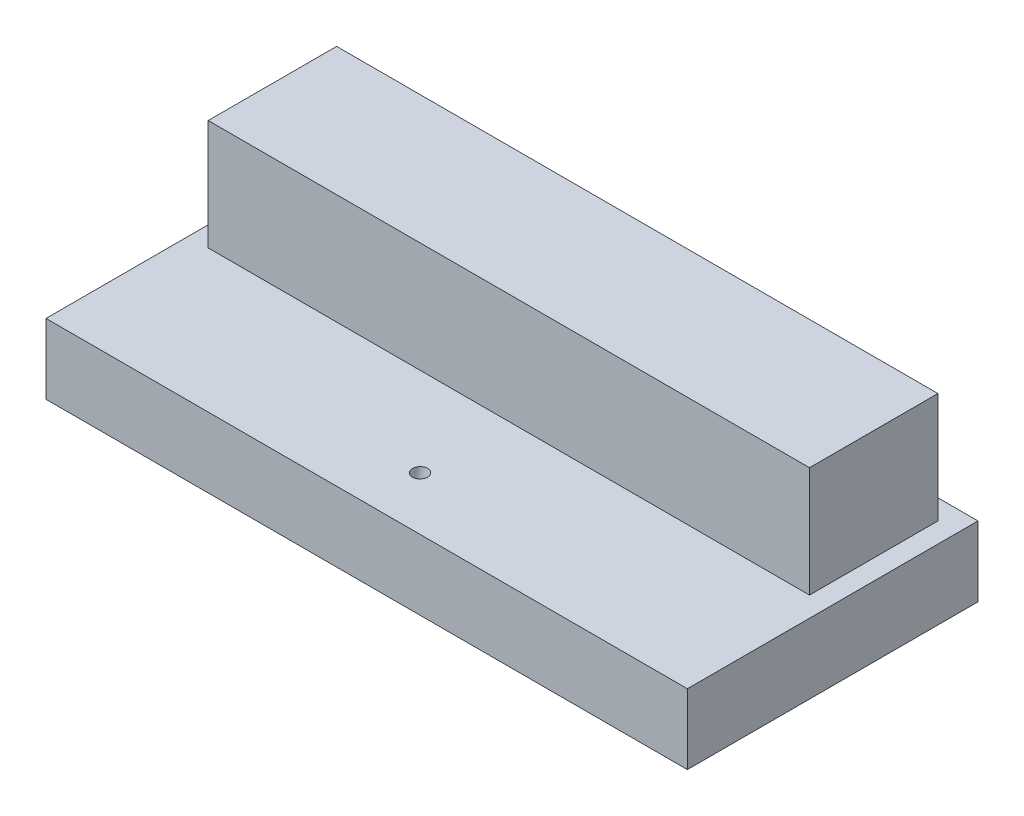
ISO-10303-21;
HEADER;
FILE_DESCRIPTION(('STEP AP214'),'2;1');
FILE_NAME('part.step','',(''),(''),'','','');
FILE_SCHEMA(('AUTOMOTIVE_DESIGN { 1 0 10303 214 1 1 1 1 }'));
ENDSEC;
DATA;
#1=APPLICATION_CONTEXT('core data for automotive mechanical design processes');
#2=APPLICATION_PROTOCOL_DEFINITION('international standard','automotive_design',2000,#1);
#3=PRODUCT_CONTEXT('',#1,'mechanical');
#4=PRODUCT('Part','Part','',(#3));
#5=PRODUCT_RELATED_PRODUCT_CATEGORY('part','',(#4));
#6=PRODUCT_DEFINITION_FORMATION('','',#4);
#7=PRODUCT_DEFINITION_CONTEXT('part definition',#1,'design');
#8=PRODUCT_DEFINITION('design','',#6,#7);
#9=PRODUCT_DEFINITION_SHAPE('','',#8);
#10=(LENGTH_UNIT() NAMED_UNIT(*) SI_UNIT(.MILLI.,.METRE.));
#11=(NAMED_UNIT(*) PLANE_ANGLE_UNIT() SI_UNIT($,.RADIAN.));
#12=(NAMED_UNIT(*) SI_UNIT($,.STERADIAN.) SOLID_ANGLE_UNIT());
#13=UNCERTAINTY_MEASURE_WITH_UNIT(LENGTH_MEASURE(1.E-05),#10,'distance_accuracy_value','');
#14=(GEOMETRIC_REPRESENTATION_CONTEXT(3) GLOBAL_UNCERTAINTY_ASSIGNED_CONTEXT((#13)) GLOBAL_UNIT_ASSIGNED_CONTEXT((#10,
#11,#12)) REPRESENTATION_CONTEXT('',''));
#15=CARTESIAN_POINT('',(0.,0.,0.));
#16=DIRECTION('',(0.,0.,1.));
#17=DIRECTION('',(1.,0.,0.));
#18=AXIS2_PLACEMENT_3D('',#15,#16,#17);
#19=CARTESIAN_POINT('',(39.035601562191,-7.74031022522725,-16.9085655572816));
#20=DIRECTION('',(0.,0.,-1.));
#21=DIRECTION('',(-1.,0.,0.));
#22=AXIS2_PLACEMENT_3D('',#19,#20,#21);
#23=PLANE('',#22);
#24=DIRECTION('',(-1.,0.,0.));
#25=VECTOR('',#24,1.);
#26=CARTESIAN_POINT('',(39.035601562191,14.2788182573859,-16.9085655572816));
#27=LINE('',#26,#25);
#28=CARTESIAN_POINT('',(39.035601562191,14.2788182573859,-16.9085655572816));
#29=VERTEX_POINT('',#28);
#30=CARTESIAN_POINT('',(-80.964398437809,14.2788182573859,-16.9085655572816));
#31=VERTEX_POINT('',#30);
#32=EDGE_CURVE('E133',#29,#31,#27,.T.);
#33=ORIENTED_EDGE('',*,*,#32,.T.);
#34=DIRECTION('',(0.,1.,0.));
#35=VECTOR('',#34,1.);
#36=CARTESIAN_POINT('',(-80.964398437809,-7.74031022522725,-16.9085655572816));
#37=LINE('',#36,#35);
#38=CARTESIAN_POINT('',(-80.964398437809,-7.74031022522725,-16.9085655572816));
#39=VERTEX_POINT('',#38);
#40=EDGE_CURVE('E11',#39,#31,#37,.T.);
#41=ORIENTED_EDGE('',*,*,#40,.F.);
#42=DIRECTION('',(-1.,0.,0.));
#43=VECTOR('',#42,1.);
#44=CARTESIAN_POINT('',(39.035601562191,-7.74031022522725,-16.9085655572816));
#45=LINE('',#44,#43);
#46=CARTESIAN_POINT('',(39.035601562191,-7.74031022522725,-16.9085655572816));
#47=VERTEX_POINT('',#46);
#48=EDGE_CURVE('E142',#47,#39,#45,.T.);
#49=ORIENTED_EDGE('',*,*,#48,.F.);
#50=DIRECTION('',(0.,1.,0.));
#51=VECTOR('',#50,1.);
#52=CARTESIAN_POINT('',(39.035601562191,-7.74031022522725,-16.9085655572816));
#53=LINE('',#52,#51);
#54=EDGE_CURVE('E151',#47,#29,#53,.T.);
#55=ORIENTED_EDGE('',*,*,#54,.T.);
#56=EDGE_LOOP('',(#33,#41,#49,#55));
#57=FACE_BOUND('',#56,.T.);
#58=ADVANCED_FACE('F33',(#57),#23,.F.);
#59=CARTESIAN_POINT('',(-80.964398437809,-7.74031022522725,-16.9085655572816));
#60=DIRECTION('',(1.,0.,0.));
#61=DIRECTION('',(0.,0.,-1.));
#62=AXIS2_PLACEMENT_3D('',#59,#60,#61);
#63=PLANE('',#62);
#64=DIRECTION('',(0.,0.,-1.));
#65=VECTOR('',#64,1.);
#66=CARTESIAN_POINT('',(-80.964398437809,14.2788182573859,-16.9085655572816));
#67=LINE('',#66,#65);
#68=CARTESIAN_POINT('',(-80.964398437809,14.2788182573859,-42.5395294604823));
#69=VERTEX_POINT('',#68);
#70=EDGE_CURVE('E136',#31,#69,#67,.T.);
#71=ORIENTED_EDGE('',*,*,#70,.T.);
#72=DIRECTION('',(0.,1.,0.));
#73=VECTOR('',#72,1.);
#74=CARTESIAN_POINT('',(-80.964398437809,-7.74031022522725,-42.5395294604823));
#75=LINE('',#74,#73);
#76=CARTESIAN_POINT('',(-80.964398437809,-7.74031022522725,-42.5395294604823));
#77=VERTEX_POINT('',#76);
#78=EDGE_CURVE('E42',#77,#69,#75,.T.);
#79=ORIENTED_EDGE('',*,*,#78,.F.);
#80=DIRECTION('',(0.,0.,-1.));
#81=VECTOR('',#80,1.);
#82=CARTESIAN_POINT('',(-80.964398437809,-7.74031022522725,-16.9085655572816));
#83=LINE('',#82,#81);
#84=EDGE_CURVE('E77',#39,#77,#83,.T.);
#85=ORIENTED_EDGE('',*,*,#84,.F.);
#86=ORIENTED_EDGE('',*,*,#40,.T.);
#87=EDGE_LOOP('',(#71,#79,#85,#86));
#88=FACE_BOUND('',#87,.T.);
#89=ADVANCED_FACE('F201',(#88),#63,.F.);
#90=CARTESIAN_POINT('',(-80.964398437809,-7.74031022522725,-42.5395294604823));
#91=DIRECTION('',(0.,0.,1.));
#92=DIRECTION('',(1.,0.,0.));
#93=AXIS2_PLACEMENT_3D('',#90,#91,#92);
#94=PLANE('',#93);
#95=DIRECTION('',(1.,0.,0.));
#96=VECTOR('',#95,1.);
#97=CARTESIAN_POINT('',(-80.964398437809,14.2788182573859,-42.5395294604823));
#98=LINE('',#97,#96);
#99=CARTESIAN_POINT('',(39.035601562191,14.2788182573859,-42.5395294604823));
#100=VERTEX_POINT('',#99);
#101=EDGE_CURVE('E67',#69,#100,#98,.T.);
#102=ORIENTED_EDGE('',*,*,#101,.T.);
#103=DIRECTION('',(0.,1.,0.));
#104=VECTOR('',#103,1.);
#105=CARTESIAN_POINT('',(39.035601562191,-7.74031022522725,-42.5395294604823));
#106=LINE('',#105,#104);
#107=CARTESIAN_POINT('',(39.035601562191,-7.74031022522725,-42.5395294604823));
#108=VERTEX_POINT('',#107);
#109=EDGE_CURVE('E51',#108,#100,#106,.T.);
#110=ORIENTED_EDGE('',*,*,#109,.F.);
#111=DIRECTION('',(1.,0.,0.));
#112=VECTOR('',#111,1.);
#113=CARTESIAN_POINT('',(-80.964398437809,-7.74031022522725,-42.5395294604823));
#114=LINE('',#113,#112);
#115=EDGE_CURVE('E146',#77,#108,#114,.T.);
#116=ORIENTED_EDGE('',*,*,#115,.F.);
#117=ORIENTED_EDGE('',*,*,#78,.T.);
#118=EDGE_LOOP('',(#102,#110,#116,#117));
#119=FACE_BOUND('',#118,.T.);
#120=ADVANCED_FACE('F206',(#119),#94,.F.);
#121=CARTESIAN_POINT('',(39.035601562191,-7.74031022522725,-42.5395294604823));
#122=DIRECTION('',(-1.,0.,0.));
#123=DIRECTION('',(0.,0.,1.));
#124=AXIS2_PLACEMENT_3D('',#121,#122,#123);
#125=PLANE('',#124);
#126=DIRECTION('',(0.,0.,1.));
#127=VECTOR('',#126,1.);
#128=CARTESIAN_POINT('',(39.035601562191,14.2788182573859,-42.5395294604823));
#129=LINE('',#128,#127);
#130=EDGE_CURVE('E72',#100,#29,#129,.T.);
#131=ORIENTED_EDGE('',*,*,#130,.T.);
#132=ORIENTED_EDGE('',*,*,#54,.F.);
#133=DIRECTION('',(0.,0.,1.));
#134=VECTOR('',#133,1.);
#135=CARTESIAN_POINT('',(39.035601562191,-7.74031022522725,-42.5395294604823));
#136=LINE('',#135,#134);
#137=EDGE_CURVE('E149',#108,#47,#136,.T.);
#138=ORIENTED_EDGE('',*,*,#137,.F.);
#139=ORIENTED_EDGE('',*,*,#109,.T.);
#140=EDGE_LOOP('',(#131,#132,#138,#139));
#141=FACE_BOUND('',#140,.T.);
#142=ADVANCED_FACE('F210',(#141),#125,.F.);
#143=CARTESIAN_POINT('',(0.,14.2788182573859,0.));
#144=DIRECTION('',(0.,-1.,0.));
#145=DIRECTION('',(0.,0.,-1.));
#146=AXIS2_PLACEMENT_3D('',#143,#144,#145);
#147=PLANE('',#146);
#148=ORIENTED_EDGE('',*,*,#32,.F.);
#149=ORIENTED_EDGE('',*,*,#130,.F.);
#150=ORIENTED_EDGE('',*,*,#101,.F.);
#151=ORIENTED_EDGE('',*,*,#70,.F.);
#152=EDGE_LOOP('',(#148,#149,#150,#151));
#153=FACE_BOUND('',#152,.T.);
#154=ADVANCED_FACE('F209',(#153),#147,.F.);
#155=CARTESIAN_POINT('',(0.,-7.74031022522725,0.));
#156=DIRECTION('',(0.,-1.,0.));
#157=DIRECTION('',(0.,0.,-1.));
#158=AXIS2_PLACEMENT_3D('',#155,#156,#157);
#159=PLANE('',#158);
#160=CARTESIAN_POINT('',(-20.964398437809,-7.74031022522725,0.815964066677682));
#161=DIRECTION('',(0.,-1.,0.));
#162=DIRECTION('',(0.,0.,1.));
#163=AXIS2_PLACEMENT_3D('',#160,#161,#162);
#164=ELLIPSE('',#163,1.52174637005962,1.5);
#165=CARTESIAN_POINT('',(-20.964398437809,-7.74031022522725,2.3377104367373));
#166=VERTEX_POINT('',#165);
#167=EDGE_CURVE('E36',#166,#166,#164,.F.);
#168=ORIENTED_EDGE('',*,*,#167,.F.);
#169=EDGE_LOOP('',(#168));
#170=FACE_BOUND('',#169,.T.);
#171=DIRECTION('',(1.,0.,0.));
#172=VECTOR('',#171,1.);
#173=CARTESIAN_POINT('',(-84.964398437809,-7.74031022522725,-46.5395294604823));
#174=LINE('',#173,#172);
#175=CARTESIAN_POINT('',(-84.964398437809,-7.74031022522725,-46.5395294604823));
#176=VERTEX_POINT('',#175);
#177=CARTESIAN_POINT('',(43.035601562191,-7.74031022522725,-46.5395294604823));
#178=VERTEX_POINT('',#177);
#179=EDGE_CURVE('E132',#176,#178,#174,.T.);
#180=ORIENTED_EDGE('',*,*,#179,.F.);
#181=DIRECTION('',(0.,0.,-1.));
#182=VECTOR('',#181,1.);
#183=CARTESIAN_POINT('',(-84.964398437809,-7.74031022522725,11.4604705395177));
#184=LINE('',#183,#182);
#185=CARTESIAN_POINT('',(-84.964398437809,-7.74031022522725,11.4604705395177));
#186=VERTEX_POINT('',#185);
#187=EDGE_CURVE('E128',#186,#176,#184,.T.);
#188=ORIENTED_EDGE('',*,*,#187,.F.);
#189=DIRECTION('',(-1.,0.,0.));
#190=VECTOR('',#189,1.);
#191=CARTESIAN_POINT('',(43.035601562191,-7.74031022522725,11.4604705395177));
#192=LINE('',#191,#190);
#193=CARTESIAN_POINT('',(43.035601562191,-7.74031022522725,11.4604705395177));
#194=VERTEX_POINT('',#193);
#195=EDGE_CURVE('E178',#194,#186,#192,.T.);
#196=ORIENTED_EDGE('',*,*,#195,.F.);
#197=DIRECTION('',(0.,0.,1.));
#198=VECTOR('',#197,1.);
#199=CARTESIAN_POINT('',(43.035601562191,-7.74031022522725,-46.5395294604823));
#200=LINE('',#199,#198);
#201=EDGE_CURVE('E176',#178,#194,#200,.T.);
#202=ORIENTED_EDGE('',*,*,#201,.F.);
#203=EDGE_LOOP('',(#180,#188,#196,#202));
#204=FACE_BOUND('',#203,.T.);
#205=ORIENTED_EDGE('',*,*,#137,.T.);
#206=ORIENTED_EDGE('',*,*,#48,.T.);
#207=ORIENTED_EDGE('',*,*,#84,.T.);
#208=ORIENTED_EDGE('',*,*,#115,.T.);
#209=EDGE_LOOP('',(#205,#206,#207,#208));
#210=FACE_BOUND('',#209,.T.);
#211=ADVANCED_FACE('F189',(#170,#204,#210),#159,.F.);
#212=CARTESIAN_POINT('',(-84.964398437809,-21.7211817426141,-46.5395294604823));
#213=DIRECTION('',(0.,0.,1.));
#214=DIRECTION('',(1.,0.,0.));
#215=AXIS2_PLACEMENT_3D('',#212,#213,#214);
#216=PLANE('',#215);
#217=ORIENTED_EDGE('',*,*,#179,.T.);
#218=DIRECTION('',(0.,1.,0.));
#219=VECTOR('',#218,1.);
#220=CARTESIAN_POINT('',(43.035601562191,-21.7211817426141,-46.5395294604823));
#221=LINE('',#220,#219);
#222=CARTESIAN_POINT('',(43.035601562191,-21.7211817426141,-46.5395294604823));
#223=VERTEX_POINT('',#222);
#224=EDGE_CURVE('E112',#223,#178,#221,.T.);
#225=ORIENTED_EDGE('',*,*,#224,.F.);
#226=DIRECTION('',(1.,0.,0.));
#227=VECTOR('',#226,1.);
#228=CARTESIAN_POINT('',(-84.964398437809,-21.7211817426141,-46.5395294604823));
#229=LINE('',#228,#227);
#230=CARTESIAN_POINT('',(-84.964398437809,-21.7211817426141,-46.5395294604823));
#231=VERTEX_POINT('',#230);
#232=EDGE_CURVE('E119',#231,#223,#229,.T.);
#233=ORIENTED_EDGE('',*,*,#232,.F.);
#234=DIRECTION('',(0.,1.,0.));
#235=VECTOR('',#234,1.);
#236=CARTESIAN_POINT('',(-84.964398437809,-21.7211817426141,-46.5395294604823));
#237=LINE('',#236,#235);
#238=EDGE_CURVE('E174',#231,#176,#237,.T.);
#239=ORIENTED_EDGE('',*,*,#238,.T.);
#240=EDGE_LOOP('',(#217,#225,#233,#239));
#241=FACE_BOUND('',#240,.T.);
#242=ADVANCED_FACE('F130',(#241),#216,.F.);
#243=CARTESIAN_POINT('',(43.035601562191,-21.7211817426141,-46.5395294604823));
#244=DIRECTION('',(-1.,0.,0.));
#245=DIRECTION('',(0.,0.,1.));
#246=AXIS2_PLACEMENT_3D('',#243,#244,#245);
#247=PLANE('',#246);
#248=ORIENTED_EDGE('',*,*,#201,.T.);
#249=DIRECTION('',(0.,1.,0.));
#250=VECTOR('',#249,1.);
#251=CARTESIAN_POINT('',(43.035601562191,-21.7211817426141,11.4604705395177));
#252=LINE('',#251,#250);
#253=CARTESIAN_POINT('',(43.035601562191,-21.7211817426141,11.4604705395177));
#254=VERTEX_POINT('',#253);
#255=EDGE_CURVE('E115',#254,#194,#252,.T.);
#256=ORIENTED_EDGE('',*,*,#255,.F.);
#257=DIRECTION('',(0.,0.,1.));
#258=VECTOR('',#257,1.);
#259=CARTESIAN_POINT('',(43.035601562191,-21.7211817426141,-46.5395294604823));
#260=LINE('',#259,#258);
#261=EDGE_CURVE('E108',#223,#254,#260,.T.);
#262=ORIENTED_EDGE('',*,*,#261,.F.);
#263=ORIENTED_EDGE('',*,*,#224,.T.);
#264=EDGE_LOOP('',(#248,#256,#262,#263));
#265=FACE_BOUND('',#264,.T.);
#266=ADVANCED_FACE('F110',(#265),#247,.F.);
#267=CARTESIAN_POINT('',(43.035601562191,-21.7211817426141,11.4604705395177));
#268=DIRECTION('',(0.,0.,-1.));
#269=DIRECTION('',(-1.,0.,0.));
#270=AXIS2_PLACEMENT_3D('',#267,#268,#269);
#271=PLANE('',#270);
#272=ORIENTED_EDGE('',*,*,#195,.T.);
#273=DIRECTION('',(0.,1.,0.));
#274=VECTOR('',#273,1.);
#275=CARTESIAN_POINT('',(-84.964398437809,-21.7211817426141,11.4604705395177));
#276=LINE('',#275,#274);
#277=CARTESIAN_POINT('',(-84.964398437809,-21.7211817426141,11.4604705395177));
#278=VERTEX_POINT('',#277);
#279=EDGE_CURVE('E138',#278,#186,#276,.T.);
#280=ORIENTED_EDGE('',*,*,#279,.F.);
#281=DIRECTION('',(-1.,0.,0.));
#282=VECTOR('',#281,1.);
#283=CARTESIAN_POINT('',(43.035601562191,-21.7211817426141,11.4604705395177));
#284=LINE('',#283,#282);
#285=EDGE_CURVE('E118',#254,#278,#284,.T.);
#286=ORIENTED_EDGE('',*,*,#285,.F.);
#287=ORIENTED_EDGE('',*,*,#255,.T.);
#288=EDGE_LOOP('',(#272,#280,#286,#287));
#289=FACE_BOUND('',#288,.T.);
#290=ADVANCED_FACE('F191',(#289),#271,.F.);
#291=CARTESIAN_POINT('',(-84.964398437809,-21.7211817426141,11.4604705395177));
#292=DIRECTION('',(1.,0.,0.));
#293=DIRECTION('',(0.,0.,-1.));
#294=AXIS2_PLACEMENT_3D('',#291,#292,#293);
#295=PLANE('',#294);
#296=ORIENTED_EDGE('',*,*,#187,.T.);
#297=ORIENTED_EDGE('',*,*,#238,.F.);
#298=DIRECTION('',(0.,0.,-1.));
#299=VECTOR('',#298,1.);
#300=CARTESIAN_POINT('',(-84.964398437809,-21.7211817426141,11.4604705395177));
#301=LINE('',#300,#299);
#302=EDGE_CURVE('E124',#278,#231,#301,.T.);
#303=ORIENTED_EDGE('',*,*,#302,.F.);
#304=ORIENTED_EDGE('',*,*,#279,.T.);
#305=EDGE_LOOP('',(#296,#297,#303,#304));
#306=FACE_BOUND('',#305,.T.);
#307=ADVANCED_FACE('F185',(#306),#295,.F.);
#308=CARTESIAN_POINT('',(0.,-21.7211817426141,0.));
#309=DIRECTION('',(0.,-1.,0.));
#310=DIRECTION('',(0.,0.,-1.));
#311=AXIS2_PLACEMENT_3D('',#308,#309,#310);
#312=PLANE('',#311);
#313=CARTESIAN_POINT('',(-20.964398437809,-21.7211817426141,3.20523487603564));
#314=DIRECTION('',(0.,-1.,0.));
#315=DIRECTION('',(0.,0.,1.));
#316=AXIS2_PLACEMENT_3D('',#313,#314,#315);
#317=ELLIPSE('',#316,3.55074153013912,3.5);
#318=CARTESIAN_POINT('',(-20.964398437809,-21.7211817426141,6.75597640617476));
#319=VERTEX_POINT('',#318);
#320=EDGE_CURVE('E158',#319,#319,#317,.T.);
#321=ORIENTED_EDGE('',*,*,#320,.F.);
#322=EDGE_LOOP('',(#321));
#323=FACE_BOUND('',#322,.T.);
#324=ORIENTED_EDGE('',*,*,#232,.T.);
#325=ORIENTED_EDGE('',*,*,#261,.T.);
#326=ORIENTED_EDGE('',*,*,#285,.T.);
#327=ORIENTED_EDGE('',*,*,#302,.T.);
#328=EDGE_LOOP('',(#324,#325,#326,#327));
#329=FACE_BOUND('',#328,.T.);
#330=ADVANCED_FACE('F122',(#323,#329),#312,.T.);
#331=CARTESIAN_POINT('',(-20.964398437809,27.8176326291864,-5.26073542928823));
#332=DIRECTION('',(0.,-0.985709596232669,0.168453530372113));
#333=DIRECTION('',(0.,-0.168453530372113,-0.985709596232669));
#334=AXIS2_PLACEMENT_3D('',#331,#332,#333);
#335=CYLINDRICAL_SURFACE('',#334,1.5);
#336=CARTESIAN_POINT('',(-20.964398437809,-13.4506291144963,1.79183300426778));
#337=DIRECTION('',(0.,0.985709596232669,-0.168453530372113));
#338=DIRECTION('',(0.,0.168453530372113,0.985709596232669));
#339=AXIS2_PLACEMENT_3D('',#336,#337,#338);
#340=CIRCLE('',#339,1.5);
#341=CARTESIAN_POINT('',(-20.964398437809,-13.1979488189382,3.27039739861678));
#342=VERTEX_POINT('',#341);
#343=EDGE_CURVE('E160',#342,#342,#340,.T.);
#344=ORIENTED_EDGE('',*,*,#343,.F.);
#345=EDGE_LOOP('',(#344));
#346=FACE_BOUND('',#345,.T.);
#347=ORIENTED_EDGE('',*,*,#167,.T.);
#348=EDGE_LOOP('',(#347));
#349=FACE_BOUND('',#348,.T.);
#350=ADVANCED_FACE('F232',(#346,#349),#335,.F.);
#351=CARTESIAN_POINT('',(-20.964398437809,-13.4506291144963,1.79183300426778));
#352=DIRECTION('',(0.,-0.985709596232669,0.168453530372113));
#353=DIRECTION('',(0.,-0.168453530372113,-0.985709596232669));
#354=AXIS2_PLACEMENT_3D('',#351,#352,#353);
#355=CYLINDRICAL_SURFACE('',#354,3.5);
#356=ORIENTED_EDGE('',*,*,#320,.T.);
#357=EDGE_LOOP('',(#356));
#358=FACE_BOUND('',#357,.T.);
#359=CARTESIAN_POINT('',(-20.964398437809,-13.4506291144963,1.79183300426778));
#360=DIRECTION('',(0.,-0.985709596232669,0.168453530372113));
#361=DIRECTION('',(0.,-0.168453530372113,-0.985709596232669));
#362=AXIS2_PLACEMENT_3D('',#359,#360,#361);
#363=CIRCLE('',#362,3.5);
#364=CARTESIAN_POINT('',(-20.964398437809,-14.0402164707987,-1.65815058254656));
#365=VERTEX_POINT('',#364);
#366=EDGE_CURVE('E165',#365,#365,#363,.T.);
#367=ORIENTED_EDGE('',*,*,#366,.F.);
#368=EDGE_LOOP('',(#367));
#369=FACE_BOUND('',#368,.T.);
#370=ADVANCED_FACE('F234',(#358,#369),#355,.F.);
#371=CARTESIAN_POINT('',(-20.964398437809,-13.4506291144963,1.79183300426778));
#372=DIRECTION('',(0.,-0.985709596232669,0.168453530372113));
#373=DIRECTION('',(0.,-0.168453530372113,-0.985709596232669));
#374=AXIS2_PLACEMENT_3D('',#371,#372,#373);
#375=PLANE('',#374);
#376=ORIENTED_EDGE('',*,*,#343,.T.);
#377=EDGE_LOOP('',(#376));
#378=FACE_BOUND('',#377,.T.);
#379=ORIENTED_EDGE('',*,*,#366,.T.);
#380=EDGE_LOOP('',(#379));
#381=FACE_BOUND('',#380,.T.);
#382=ADVANCED_FACE('F237',(#378,#381),#375,.T.);
#383=CLOSED_SHELL('',(#58,#89,#120,#142,#154,#211,#242,#266,#290,#307,#330,#350,#370,#382));
#384=MANIFOLD_SOLID_BREP('B2',#383);
#385=ADVANCED_BREP_SHAPE_REPRESENTATION('',(#18,#384),#14);
#386=SHAPE_DEFINITION_REPRESENTATION(#9,#385);
ENDSEC;
END-ISO-10303-21;
